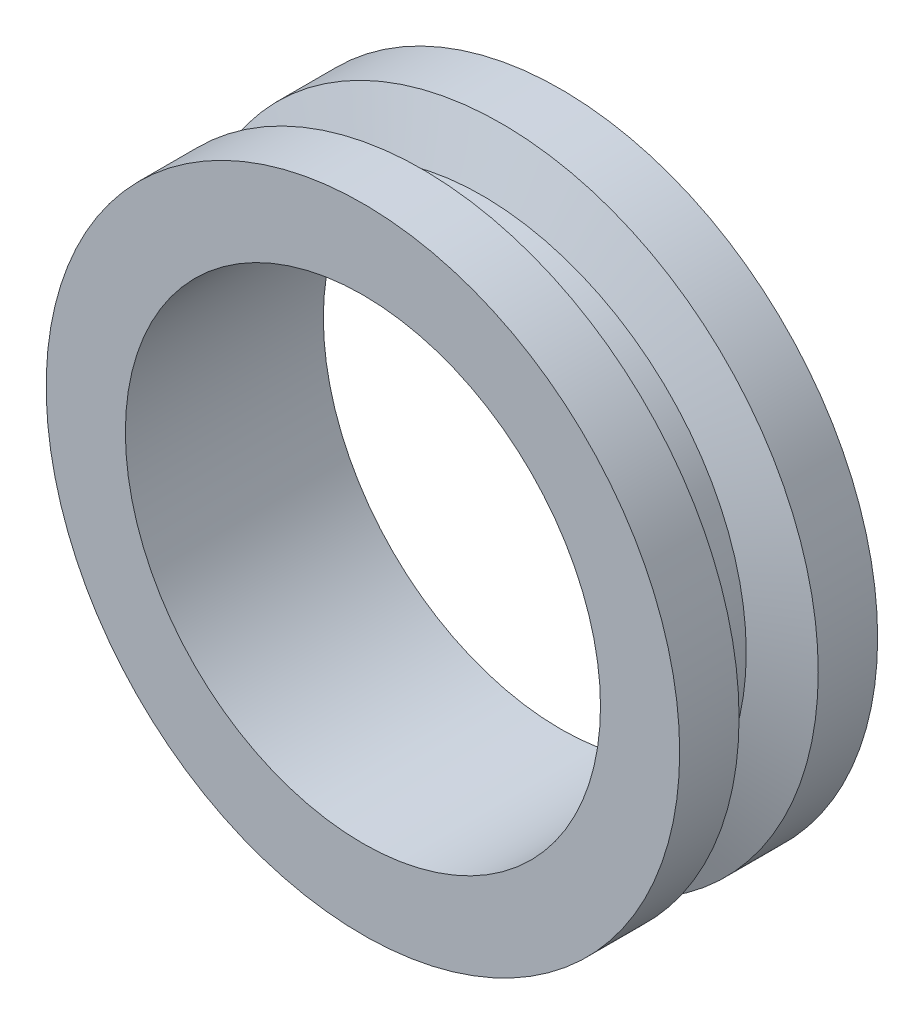
ISO-10303-21;
HEADER;
FILE_DESCRIPTION(('STEP AP214'),'2;1');
FILE_NAME('part.step','',(''),(''),'','','');
FILE_SCHEMA(('AUTOMOTIVE_DESIGN { 1 0 10303 214 1 1 1 1 }'));
ENDSEC;
DATA;
#1=APPLICATION_CONTEXT('core data for automotive mechanical design processes');
#2=APPLICATION_PROTOCOL_DEFINITION('international standard','automotive_design',2000,#1);
#3=PRODUCT_CONTEXT('',#1,'mechanical');
#4=PRODUCT('Part','Part','',(#3));
#5=PRODUCT_RELATED_PRODUCT_CATEGORY('part','',(#4));
#6=PRODUCT_DEFINITION_FORMATION('','',#4);
#7=PRODUCT_DEFINITION_CONTEXT('part definition',#1,'design');
#8=PRODUCT_DEFINITION('design','',#6,#7);
#9=PRODUCT_DEFINITION_SHAPE('','',#8);
#10=(LENGTH_UNIT() NAMED_UNIT(*) SI_UNIT(.MILLI.,.METRE.));
#11=(NAMED_UNIT(*) PLANE_ANGLE_UNIT() SI_UNIT($,.RADIAN.));
#12=(NAMED_UNIT(*) SI_UNIT($,.STERADIAN.) SOLID_ANGLE_UNIT());
#13=UNCERTAINTY_MEASURE_WITH_UNIT(LENGTH_MEASURE(1.E-05),#10,'distance_accuracy_value','');
#14=(GEOMETRIC_REPRESENTATION_CONTEXT(3) GLOBAL_UNCERTAINTY_ASSIGNED_CONTEXT((#13)) GLOBAL_UNIT_ASSIGNED_CONTEXT((#10,
#11,#12)) REPRESENTATION_CONTEXT('',''));
#15=CARTESIAN_POINT('',(0.,0.,0.));
#16=DIRECTION('',(0.,0.,1.));
#17=DIRECTION('',(1.,0.,0.));
#18=AXIS2_PLACEMENT_3D('',#15,#16,#17);
#19=CARTESIAN_POINT('',(18.,0.,-7.5));
#20=DIRECTION('',(0.,0.,-1.));
#21=DIRECTION('',(-1.,0.,0.));
#22=AXIS2_PLACEMENT_3D('',#19,#20,#21);
#23=PLANE('',#22);
#24=CARTESIAN_POINT('',(0.,0.,-7.5));
#25=DIRECTION('',(0.,0.,1.));
#26=DIRECTION('',(1.,0.,0.));
#27=AXIS2_PLACEMENT_3D('',#24,#25,#26);
#28=CIRCLE('',#27,18.);
#29=CARTESIAN_POINT('',(18.,0.,-7.5));
#30=VERTEX_POINT('',#29);
#31=EDGE_CURVE('E72',#30,#30,#28,.T.);
#32=ORIENTED_EDGE('',*,*,#31,.T.);
#33=EDGE_LOOP('',(#32));
#34=FACE_BOUND('',#33,.T.);
#35=CARTESIAN_POINT('',(0.,0.,-7.5));
#36=DIRECTION('',(0.,0.,1.));
#37=DIRECTION('',(1.,0.,0.));
#38=AXIS2_PLACEMENT_3D('',#35,#36,#37);
#39=CIRCLE('',#38,24.);
#40=CARTESIAN_POINT('',(24.,0.,-7.5));
#41=VERTEX_POINT('',#40);
#42=EDGE_CURVE('E10',#41,#41,#39,.T.);
#43=ORIENTED_EDGE('',*,*,#42,.F.);
#44=EDGE_LOOP('',(#43));
#45=FACE_BOUND('',#44,.T.);
#46=ADVANCED_FACE('F37',(#34,#45),#23,.T.);
#47=CARTESIAN_POINT('',(0.,0.,7.5));
#48=DIRECTION('',(0.,0.,1.));
#49=DIRECTION('',(1.,0.,0.));
#50=AXIS2_PLACEMENT_3D('',#47,#48,#49);
#51=CYLINDRICAL_SURFACE('',#50,24.);
#52=ORIENTED_EDGE('',*,*,#42,.T.);
#53=EDGE_LOOP('',(#52));
#54=FACE_BOUND('',#53,.T.);
#55=CARTESIAN_POINT('',(0.,0.,-3.));
#56=DIRECTION('',(0.,0.,1.));
#57=DIRECTION('',(1.,0.,0.));
#58=AXIS2_PLACEMENT_3D('',#55,#56,#57);
#59=CIRCLE('',#58,24.);
#60=CARTESIAN_POINT('',(24.,0.,-3.));
#61=VERTEX_POINT('',#60);
#62=EDGE_CURVE('E44',#61,#61,#59,.T.);
#63=ORIENTED_EDGE('',*,*,#62,.F.);
#64=EDGE_LOOP('',(#63));
#65=FACE_BOUND('',#64,.T.);
#66=ADVANCED_FACE('F91',(#54,#65),#51,.T.);
#67=CARTESIAN_POINT('',(0.,0.,-1.5441190629352));
#68=DIRECTION('',(0.,0.,-1.));
#69=DIRECTION('',(-1.,0.,0.));
#70=AXIS2_PLACEMENT_3D('',#67,#68,#69);
#71=CONICAL_SURFACE('',#70,20.,1.22173047639603);
#72=ORIENTED_EDGE('',*,*,#62,.T.);
#73=EDGE_LOOP('',(#72));
#74=FACE_BOUND('',#73,.T.);
#75=CARTESIAN_POINT('',(0.,0.,-1.5441190629352));
#76=DIRECTION('',(0.,0.,1.));
#77=DIRECTION('',(1.,0.,0.));
#78=AXIS2_PLACEMENT_3D('',#75,#76,#77);
#79=CIRCLE('',#78,20.);
#80=CARTESIAN_POINT('',(20.,0.,-1.5441190629352));
#81=VERTEX_POINT('',#80);
#82=EDGE_CURVE('E49',#81,#81,#79,.T.);
#83=ORIENTED_EDGE('',*,*,#82,.F.);
#84=EDGE_LOOP('',(#83));
#85=FACE_BOUND('',#84,.T.);
#86=ADVANCED_FACE('F95',(#74,#85),#71,.T.);
#87=CARTESIAN_POINT('',(0.,0.,7.5));
#88=DIRECTION('',(0.,0.,1.));
#89=DIRECTION('',(1.,0.,0.));
#90=AXIS2_PLACEMENT_3D('',#87,#88,#89);
#91=CYLINDRICAL_SURFACE('',#90,20.);
#92=ORIENTED_EDGE('',*,*,#82,.T.);
#93=EDGE_LOOP('',(#92));
#94=FACE_BOUND('',#93,.T.);
#95=CARTESIAN_POINT('',(0.,0.,1.5441190629352));
#96=DIRECTION('',(0.,0.,1.));
#97=DIRECTION('',(1.,0.,0.));
#98=AXIS2_PLACEMENT_3D('',#95,#96,#97);
#99=CIRCLE('',#98,20.);
#100=CARTESIAN_POINT('',(20.,0.,1.5441190629352));
#101=VERTEX_POINT('',#100);
#102=EDGE_CURVE('E54',#101,#101,#99,.T.);
#103=ORIENTED_EDGE('',*,*,#102,.F.);
#104=EDGE_LOOP('',(#103));
#105=FACE_BOUND('',#104,.T.);
#106=ADVANCED_FACE('F99',(#94,#105),#91,.T.);
#107=CARTESIAN_POINT('',(0.,0.,3.));
#108=DIRECTION('',(0.,0.,1.));
#109=DIRECTION('',(1.,0.,0.));
#110=AXIS2_PLACEMENT_3D('',#107,#108,#109);
#111=CONICAL_SURFACE('',#110,24.,1.22173047639603);
#112=ORIENTED_EDGE('',*,*,#102,.T.);
#113=EDGE_LOOP('',(#112));
#114=FACE_BOUND('',#113,.T.);
#115=CARTESIAN_POINT('',(0.,0.,3.));
#116=DIRECTION('',(0.,0.,1.));
#117=DIRECTION('',(1.,0.,0.));
#118=AXIS2_PLACEMENT_3D('',#115,#116,#117);
#119=CIRCLE('',#118,24.);
#120=CARTESIAN_POINT('',(24.,0.,3.));
#121=VERTEX_POINT('',#120);
#122=EDGE_CURVE('E60',#121,#121,#119,.T.);
#123=ORIENTED_EDGE('',*,*,#122,.F.);
#124=EDGE_LOOP('',(#123));
#125=FACE_BOUND('',#124,.T.);
#126=ADVANCED_FACE('F105',(#114,#125),#111,.T.);
#127=CARTESIAN_POINT('',(0.,0.,7.5));
#128=DIRECTION('',(0.,0.,1.));
#129=DIRECTION('',(1.,0.,0.));
#130=AXIS2_PLACEMENT_3D('',#127,#128,#129);
#131=CYLINDRICAL_SURFACE('',#130,24.);
#132=ORIENTED_EDGE('',*,*,#122,.T.);
#133=EDGE_LOOP('',(#132));
#134=FACE_BOUND('',#133,.T.);
#135=CARTESIAN_POINT('',(0.,0.,7.5));
#136=DIRECTION('',(0.,0.,1.));
#137=DIRECTION('',(1.,0.,0.));
#138=AXIS2_PLACEMENT_3D('',#135,#136,#137);
#139=CIRCLE('',#138,24.);
#140=CARTESIAN_POINT('',(24.,0.,7.5));
#141=VERTEX_POINT('',#140);
#142=EDGE_CURVE('E64',#141,#141,#139,.T.);
#143=ORIENTED_EDGE('',*,*,#142,.F.);
#144=EDGE_LOOP('',(#143));
#145=FACE_BOUND('',#144,.T.);
#146=ADVANCED_FACE('F87',(#134,#145),#131,.T.);
#147=CARTESIAN_POINT('',(24.,0.,7.5));
#148=DIRECTION('',(0.,0.,1.));
#149=DIRECTION('',(1.,0.,0.));
#150=AXIS2_PLACEMENT_3D('',#147,#148,#149);
#151=PLANE('',#150);
#152=ORIENTED_EDGE('',*,*,#142,.T.);
#153=EDGE_LOOP('',(#152));
#154=FACE_BOUND('',#153,.T.);
#155=CARTESIAN_POINT('',(0.,0.,7.5));
#156=DIRECTION('',(0.,0.,1.));
#157=DIRECTION('',(1.,0.,0.));
#158=AXIS2_PLACEMENT_3D('',#155,#156,#157);
#159=CIRCLE('',#158,18.);
#160=CARTESIAN_POINT('',(18.,0.,7.5));
#161=VERTEX_POINT('',#160);
#162=EDGE_CURVE('E68',#161,#161,#159,.T.);
#163=ORIENTED_EDGE('',*,*,#162,.F.);
#164=EDGE_LOOP('',(#163));
#165=FACE_BOUND('',#164,.T.);
#166=ADVANCED_FACE('F81',(#154,#165),#151,.T.);
#167=CARTESIAN_POINT('',(0.,0.,7.5));
#168=DIRECTION('',(0.,0.,1.));
#169=DIRECTION('',(1.,0.,0.));
#170=AXIS2_PLACEMENT_3D('',#167,#168,#169);
#171=CYLINDRICAL_SURFACE('',#170,18.);
#172=ORIENTED_EDGE('',*,*,#162,.T.);
#173=EDGE_LOOP('',(#172));
#174=FACE_BOUND('',#173,.T.);
#175=ORIENTED_EDGE('',*,*,#31,.F.);
#176=EDGE_LOOP('',(#175));
#177=FACE_BOUND('',#176,.T.);
#178=ADVANCED_FACE('F79',(#174,#177),#171,.F.);
#179=CLOSED_SHELL('',(#46,#66,#86,#106,#126,#146,#166,#178));
#180=MANIFOLD_SOLID_BREP('B2',#179);
#181=ADVANCED_BREP_SHAPE_REPRESENTATION('',(#18,#180),#14);
#182=SHAPE_DEFINITION_REPRESENTATION(#9,#181);
ENDSEC;
END-ISO-10303-21;
